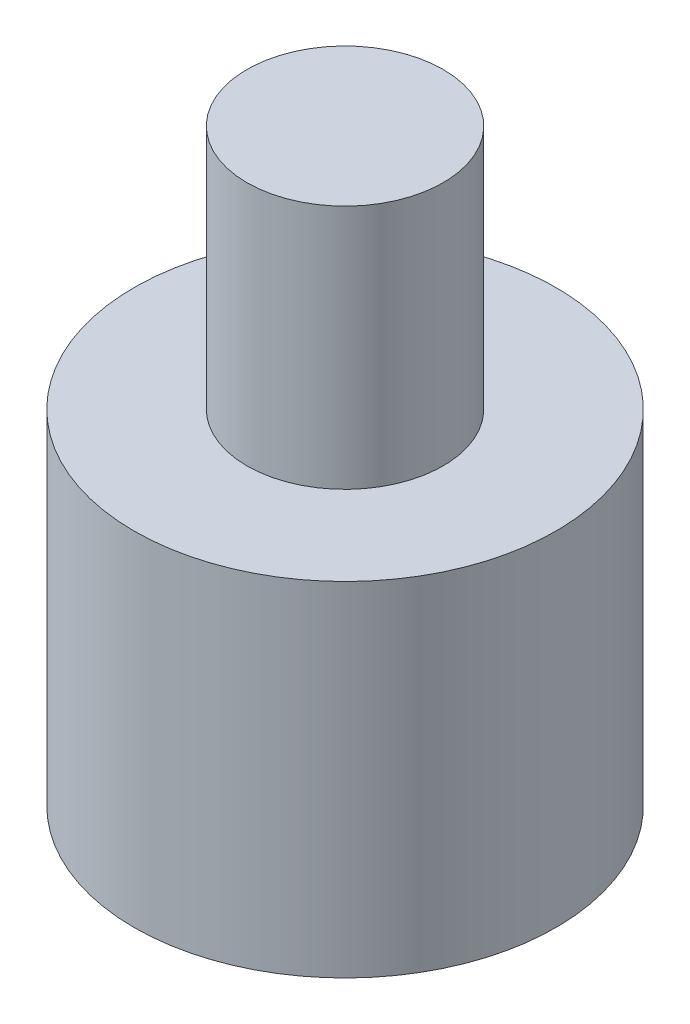
ISO-10303-21;
HEADER;
FILE_DESCRIPTION(('STEP AP214'),'2;1');
FILE_NAME('part.step','',(''),(''),'','','');
FILE_SCHEMA(('AUTOMOTIVE_DESIGN { 1 0 10303 214 1 1 1 1 }'));
ENDSEC;
DATA;
#1=APPLICATION_CONTEXT('core data for automotive mechanical design processes');
#2=APPLICATION_PROTOCOL_DEFINITION('international standard','automotive_design',2000,#1);
#3=PRODUCT_CONTEXT('',#1,'mechanical');
#4=PRODUCT('Part','Part','',(#3));
#5=PRODUCT_RELATED_PRODUCT_CATEGORY('part','',(#4));
#6=PRODUCT_DEFINITION_FORMATION('','',#4);
#7=PRODUCT_DEFINITION_CONTEXT('part definition',#1,'design');
#8=PRODUCT_DEFINITION('design','',#6,#7);
#9=PRODUCT_DEFINITION_SHAPE('','',#8);
#10=(LENGTH_UNIT() NAMED_UNIT(*) SI_UNIT(.MILLI.,.METRE.));
#11=(NAMED_UNIT(*) PLANE_ANGLE_UNIT() SI_UNIT($,.RADIAN.));
#12=(NAMED_UNIT(*) SI_UNIT($,.STERADIAN.) SOLID_ANGLE_UNIT());
#13=UNCERTAINTY_MEASURE_WITH_UNIT(LENGTH_MEASURE(1.E-05),#10,'distance_accuracy_value','');
#14=(GEOMETRIC_REPRESENTATION_CONTEXT(3) GLOBAL_UNCERTAINTY_ASSIGNED_CONTEXT((#13)) GLOBAL_UNIT_ASSIGNED_CONTEXT((#10,
#11,#12)) REPRESENTATION_CONTEXT('',''));
#15=CARTESIAN_POINT('',(0.,0.,0.));
#16=DIRECTION('',(0.,0.,1.));
#17=DIRECTION('',(1.,0.,0.));
#18=AXIS2_PLACEMENT_3D('',#15,#16,#17);
#19=CARTESIAN_POINT('',(0.,6.,0.));
#20=DIRECTION('',(0.,-1.,0.));
#21=DIRECTION('',(0.,0.,-1.));
#22=AXIS2_PLACEMENT_3D('',#19,#20,#21);
#23=CYLINDRICAL_SURFACE('',#22,2.15);
#24=CARTESIAN_POINT('',(0.,0.,0.));
#25=DIRECTION('',(0.,1.,0.));
#26=DIRECTION('',(0.,0.,1.));
#27=AXIS2_PLACEMENT_3D('',#24,#25,#26);
#28=CIRCLE('',#27,2.15);
#29=CARTESIAN_POINT('',(0.,0.,2.15));
#30=VERTEX_POINT('',#29);
#31=EDGE_CURVE('E11',#30,#30,#28,.T.);
#32=ORIENTED_EDGE('',*,*,#31,.T.);
#33=EDGE_LOOP('',(#32));
#34=FACE_BOUND('',#33,.T.);
#35=CARTESIAN_POINT('',(0.,3.5,0.));
#36=DIRECTION('',(0.,1.,0.));
#37=DIRECTION('',(0.,0.,1.));
#38=AXIS2_PLACEMENT_3D('',#35,#36,#37);
#39=CIRCLE('',#38,2.15);
#40=CARTESIAN_POINT('',(0.,3.5,2.15));
#41=VERTEX_POINT('',#40);
#42=EDGE_CURVE('E53',#41,#41,#39,.T.);
#43=ORIENTED_EDGE('',*,*,#42,.F.);
#44=EDGE_LOOP('',(#43));
#45=FACE_BOUND('',#44,.T.);
#46=ADVANCED_FACE('F47',(#34,#45),#23,.T.);
#47=CARTESIAN_POINT('',(0.,0.,0.));
#48=DIRECTION('',(0.,1.,0.));
#49=DIRECTION('',(0.,0.,1.));
#50=AXIS2_PLACEMENT_3D('',#47,#48,#49);
#51=PLANE('',#50);
#52=CARTESIAN_POINT('',(0.,0.,0.));
#53=DIRECTION('',(0.,-1.,0.));
#54=DIRECTION('',(0.,0.,-1.));
#55=AXIS2_PLACEMENT_3D('',#52,#53,#54);
#56=CIRCLE('',#55,0.79999999999999);
#57=CARTESIAN_POINT('',(0.,0.,-0.79999999999999));
#58=VERTEX_POINT('',#57);
#59=EDGE_CURVE('E67',#58,#58,#56,.T.);
#60=ORIENTED_EDGE('',*,*,#59,.F.);
#61=EDGE_LOOP('',(#60));
#62=FACE_BOUND('',#61,.T.);
#63=ORIENTED_EDGE('',*,*,#31,.F.);
#64=EDGE_LOOP('',(#63));
#65=FACE_BOUND('',#64,.T.);
#66=ADVANCED_FACE('F82',(#62,#65),#51,.F.);
#67=CARTESIAN_POINT('',(0.,3.5,0.));
#68=DIRECTION('',(0.,1.,0.));
#69=DIRECTION('',(0.,0.,1.));
#70=AXIS2_PLACEMENT_3D('',#67,#68,#69);
#71=PLANE('',#70);
#72=CARTESIAN_POINT('',(0.,3.5,0.));
#73=DIRECTION('',(0.,1.,0.));
#74=DIRECTION('',(0.,0.,1.));
#75=AXIS2_PLACEMENT_3D('',#72,#73,#74);
#76=CIRCLE('',#75,1.);
#77=CARTESIAN_POINT('',(0.,3.5,1.));
#78=VERTEX_POINT('',#77);
#79=EDGE_CURVE('E70',#78,#78,#76,.T.);
#80=ORIENTED_EDGE('',*,*,#79,.F.);
#81=EDGE_LOOP('',(#80));
#82=FACE_BOUND('',#81,.T.);
#83=ORIENTED_EDGE('',*,*,#42,.T.);
#84=EDGE_LOOP('',(#83));
#85=FACE_BOUND('',#84,.T.);
#86=ADVANCED_FACE('F79',(#82,#85),#71,.T.);
#87=CARTESIAN_POINT('',(0.,3.5,0.));
#88=DIRECTION('',(0.,1.,0.));
#89=DIRECTION('',(0.,0.,1.));
#90=AXIS2_PLACEMENT_3D('',#87,#88,#89);
#91=CYLINDRICAL_SURFACE('',#90,1.);
#92=ORIENTED_EDGE('',*,*,#79,.T.);
#93=EDGE_LOOP('',(#92));
#94=FACE_BOUND('',#93,.T.);
#95=CARTESIAN_POINT('',(0.,6.,0.));
#96=DIRECTION('',(0.,1.,0.));
#97=DIRECTION('',(0.,0.,1.));
#98=AXIS2_PLACEMENT_3D('',#95,#96,#97);
#99=CIRCLE('',#98,1.);
#100=CARTESIAN_POINT('',(0.,6.,1.));
#101=VERTEX_POINT('',#100);
#102=EDGE_CURVE('E66',#101,#101,#99,.T.);
#103=ORIENTED_EDGE('',*,*,#102,.F.);
#104=EDGE_LOOP('',(#103));
#105=FACE_BOUND('',#104,.T.);
#106=ADVANCED_FACE('F93',(#94,#105),#91,.T.);
#107=CARTESIAN_POINT('',(0.,6.,0.));
#108=DIRECTION('',(0.,1.,0.));
#109=DIRECTION('',(0.,0.,1.));
#110=AXIS2_PLACEMENT_3D('',#107,#108,#109);
#111=PLANE('',#110);
#112=ORIENTED_EDGE('',*,*,#102,.T.);
#113=EDGE_LOOP('',(#112));
#114=FACE_BOUND('',#113,.T.);
#115=ADVANCED_FACE('F60',(#114),#111,.T.);
#116=CARTESIAN_POINT('',(0.,3.5,0.));
#117=DIRECTION('',(0.,-1.,0.));
#118=DIRECTION('',(0.,0.,-1.));
#119=AXIS2_PLACEMENT_3D('',#116,#117,#118);
#120=CONICAL_SURFACE('',#119,0.799999999999999,1.02974425867665);
#121=CARTESIAN_POINT('',(0.,3.98068849522205,0.));
#122=VERTEX_POINT('',#121);
#123=VERTEX_LOOP('',#122);
#124=FACE_BOUND('',#123,.T.);
#125=CARTESIAN_POINT('',(0.,3.5,0.));
#126=DIRECTION('',(0.,-1.,0.));
#127=DIRECTION('',(0.,0.,-1.));
#128=AXIS2_PLACEMENT_3D('',#125,#126,#127);
#129=CIRCLE('',#128,0.799999999999999);
#130=CARTESIAN_POINT('',(0.,3.5,-0.799999999999999));
#131=VERTEX_POINT('',#130);
#132=EDGE_CURVE('E64',#131,#131,#129,.T.);
#133=ORIENTED_EDGE('',*,*,#132,.T.);
#134=EDGE_LOOP('',(#133));
#135=FACE_BOUND('',#134,.T.);
#136=ADVANCED_FACE('F56',(#124,#135),#120,.F.);
#137=CARTESIAN_POINT('',(0.,0.,0.));
#138=DIRECTION('',(0.,-1.,0.));
#139=DIRECTION('',(0.,0.,-1.));
#140=AXIS2_PLACEMENT_3D('',#137,#138,#139);
#141=CYLINDRICAL_SURFACE('',#140,0.799999999999994);
#142=ORIENTED_EDGE('',*,*,#132,.F.);
#143=EDGE_LOOP('',(#142));
#144=FACE_BOUND('',#143,.T.);
#145=ORIENTED_EDGE('',*,*,#59,.T.);
#146=EDGE_LOOP('',(#145));
#147=FACE_BOUND('',#146,.T.);
#148=ADVANCED_FACE('F59',(#144,#147),#141,.F.);
#149=CLOSED_SHELL('',(#46,#66,#86,#106,#115,#136,#148));
#150=MANIFOLD_SOLID_BREP('B2',#149);
#151=ADVANCED_BREP_SHAPE_REPRESENTATION('',(#18,#150),#14);
#152=SHAPE_DEFINITION_REPRESENTATION(#9,#151);
ENDSEC;
END-ISO-10303-21;
